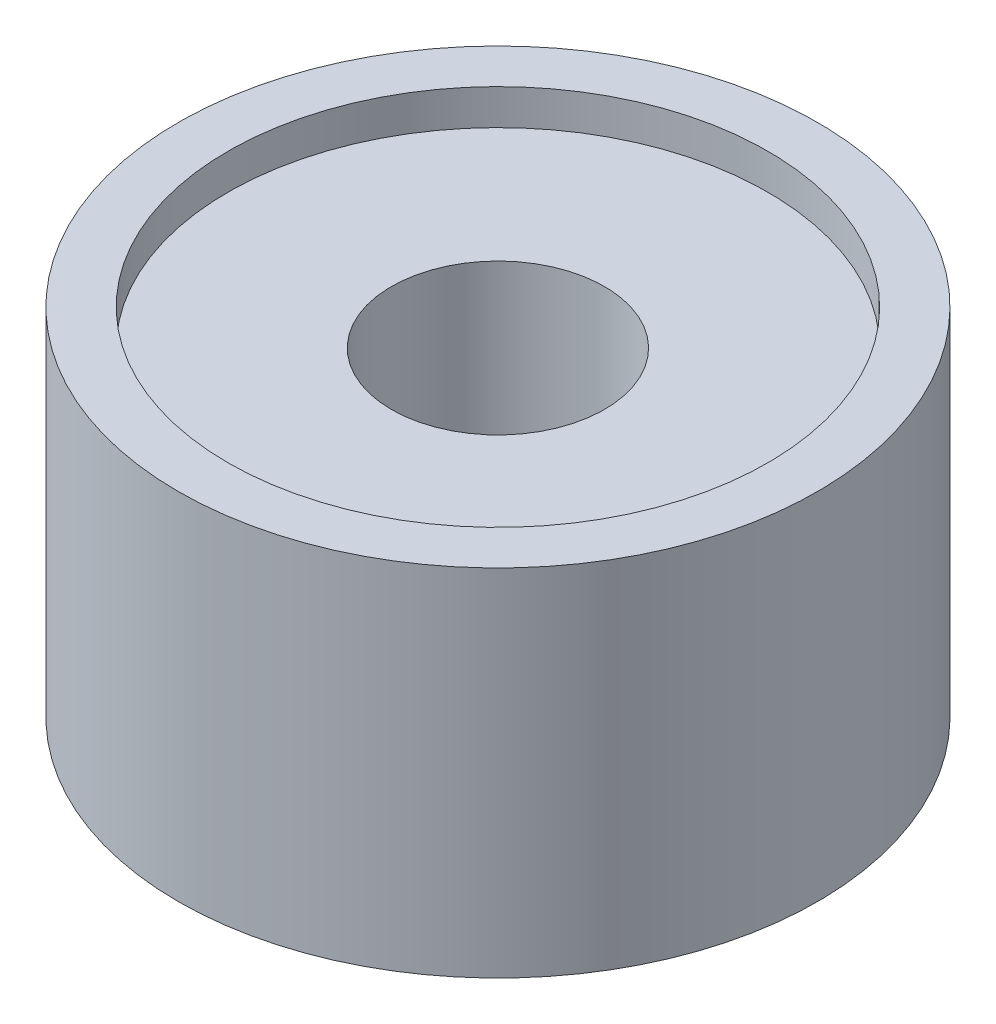
ISO-10303-21;
HEADER;
FILE_DESCRIPTION(('STEP AP214'),'2;1');
FILE_NAME('part.step','',(''),(''),'','','');
FILE_SCHEMA(('AUTOMOTIVE_DESIGN { 1 0 10303 214 1 1 1 1 }'));
ENDSEC;
DATA;
#1=APPLICATION_CONTEXT('core data for automotive mechanical design processes');
#2=APPLICATION_PROTOCOL_DEFINITION('international standard','automotive_design',2000,#1);
#3=PRODUCT_CONTEXT('',#1,'mechanical');
#4=PRODUCT('Part','Part','',(#3));
#5=PRODUCT_RELATED_PRODUCT_CATEGORY('part','',(#4));
#6=PRODUCT_DEFINITION_FORMATION('','',#4);
#7=PRODUCT_DEFINITION_CONTEXT('part definition',#1,'design');
#8=PRODUCT_DEFINITION('design','',#6,#7);
#9=PRODUCT_DEFINITION_SHAPE('','',#8);
#10=(LENGTH_UNIT() NAMED_UNIT(*) SI_UNIT(.MILLI.,.METRE.));
#11=(NAMED_UNIT(*) PLANE_ANGLE_UNIT() SI_UNIT($,.RADIAN.));
#12=(NAMED_UNIT(*) SI_UNIT($,.STERADIAN.) SOLID_ANGLE_UNIT());
#13=UNCERTAINTY_MEASURE_WITH_UNIT(LENGTH_MEASURE(1.E-05),#10,'distance_accuracy_value','');
#14=(GEOMETRIC_REPRESENTATION_CONTEXT(3) GLOBAL_UNCERTAINTY_ASSIGNED_CONTEXT((#13)) GLOBAL_UNIT_ASSIGNED_CONTEXT((#10,
#11,#12)) REPRESENTATION_CONTEXT('',''));
#15=CARTESIAN_POINT('',(0.,0.,0.));
#16=DIRECTION('',(0.,0.,1.));
#17=DIRECTION('',(1.,0.,0.));
#18=AXIS2_PLACEMENT_3D('',#15,#16,#17);
#19=CARTESIAN_POINT('',(0.,0.,0.));
#20=DIRECTION('',(0.,1.,0.));
#21=DIRECTION('',(0.,0.,1.));
#22=AXIS2_PLACEMENT_3D('',#19,#20,#21);
#23=CYLINDRICAL_SURFACE('',#22,1.5);
#24=CARTESIAN_POINT('',(0.,0.,0.));
#25=DIRECTION('',(0.,1.,0.));
#26=DIRECTION('',(0.,0.,1.));
#27=AXIS2_PLACEMENT_3D('',#24,#25,#26);
#28=CIRCLE('',#27,1.5);
#29=CARTESIAN_POINT('',(0.,0.,1.5));
#30=VERTEX_POINT('',#29);
#31=EDGE_CURVE('E44',#30,#30,#28,.T.);
#32=ORIENTED_EDGE('',*,*,#31,.F.);
#33=EDGE_LOOP('',(#32));
#34=FACE_BOUND('',#33,.T.);
#35=CARTESIAN_POINT('',(0.,4.5,0.));
#36=DIRECTION('',(0.,1.,0.));
#37=DIRECTION('',(0.,0.,1.));
#38=AXIS2_PLACEMENT_3D('',#35,#36,#37);
#39=CIRCLE('',#38,1.5);
#40=CARTESIAN_POINT('',(0.,4.5,1.5));
#41=VERTEX_POINT('',#40);
#42=EDGE_CURVE('E35',#41,#41,#39,.F.);
#43=ORIENTED_EDGE('',*,*,#42,.F.);
#44=EDGE_LOOP('',(#43));
#45=FACE_BOUND('',#44,.T.);
#46=ADVANCED_FACE('F31',(#34,#45),#23,.F.);
#47=CARTESIAN_POINT('',(0.,5.,0.));
#48=DIRECTION('',(0.,-1.,0.));
#49=DIRECTION('',(0.,0.,-1.));
#50=AXIS2_PLACEMENT_3D('',#47,#48,#49);
#51=CYLINDRICAL_SURFACE('',#50,4.5);
#52=CARTESIAN_POINT('',(0.,5.,0.));
#53=DIRECTION('',(0.,1.,0.));
#54=DIRECTION('',(0.,0.,1.));
#55=AXIS2_PLACEMENT_3D('',#52,#53,#54);
#56=CIRCLE('',#55,4.5);
#57=CARTESIAN_POINT('',(0.,5.,4.5));
#58=VERTEX_POINT('',#57);
#59=EDGE_CURVE('E10',#58,#58,#56,.T.);
#60=ORIENTED_EDGE('',*,*,#59,.F.);
#61=EDGE_LOOP('',(#60));
#62=FACE_BOUND('',#61,.T.);
#63=CARTESIAN_POINT('',(0.,0.,0.));
#64=DIRECTION('',(0.,1.,0.));
#65=DIRECTION('',(0.,0.,1.));
#66=AXIS2_PLACEMENT_3D('',#63,#64,#65);
#67=CIRCLE('',#66,4.5);
#68=CARTESIAN_POINT('',(0.,0.,4.5));
#69=VERTEX_POINT('',#68);
#70=EDGE_CURVE('E39',#69,#69,#67,.T.);
#71=ORIENTED_EDGE('',*,*,#70,.T.);
#72=EDGE_LOOP('',(#71));
#73=FACE_BOUND('',#72,.T.);
#74=ADVANCED_FACE('F33',(#62,#73),#51,.T.);
#75=CARTESIAN_POINT('',(0.,5.,0.));
#76=DIRECTION('',(0.,1.,0.));
#77=DIRECTION('',(0.,0.,1.));
#78=AXIS2_PLACEMENT_3D('',#75,#76,#77);
#79=PLANE('',#78);
#80=CARTESIAN_POINT('',(0.,5.,0.));
#81=DIRECTION('',(0.,1.,0.));
#82=DIRECTION('',(0.,0.,1.));
#83=AXIS2_PLACEMENT_3D('',#80,#81,#82);
#84=CIRCLE('',#83,3.8);
#85=CARTESIAN_POINT('',(0.,5.,3.8));
#86=VERTEX_POINT('',#85);
#87=EDGE_CURVE('E48',#86,#86,#84,.T.);
#88=ORIENTED_EDGE('',*,*,#87,.F.);
#89=EDGE_LOOP('',(#88));
#90=FACE_BOUND('',#89,.T.);
#91=ORIENTED_EDGE('',*,*,#59,.T.);
#92=EDGE_LOOP('',(#91));
#93=FACE_BOUND('',#92,.T.);
#94=ADVANCED_FACE('F66',(#90,#93),#79,.T.);
#95=CARTESIAN_POINT('',(0.,0.,0.));
#96=DIRECTION('',(0.,1.,0.));
#97=DIRECTION('',(0.,0.,1.));
#98=AXIS2_PLACEMENT_3D('',#95,#96,#97);
#99=PLANE('',#98);
#100=ORIENTED_EDGE('',*,*,#31,.T.);
#101=EDGE_LOOP('',(#100));
#102=FACE_BOUND('',#101,.T.);
#103=ORIENTED_EDGE('',*,*,#70,.F.);
#104=EDGE_LOOP('',(#103));
#105=FACE_BOUND('',#104,.T.);
#106=ADVANCED_FACE('F74',(#102,#105),#99,.F.);
#107=CARTESIAN_POINT('',(0.,4.5,0.));
#108=DIRECTION('',(0.,1.,0.));
#109=DIRECTION('',(0.,0.,1.));
#110=AXIS2_PLACEMENT_3D('',#107,#108,#109);
#111=PLANE('',#110);
#112=CARTESIAN_POINT('',(0.,4.5,0.));
#113=DIRECTION('',(0.,1.,0.));
#114=DIRECTION('',(0.,0.,1.));
#115=AXIS2_PLACEMENT_3D('',#112,#113,#114);
#116=CIRCLE('',#115,3.8);
#117=CARTESIAN_POINT('',(0.,4.5,3.8));
#118=VERTEX_POINT('',#117);
#119=EDGE_CURVE('E51',#118,#118,#116,.T.);
#120=ORIENTED_EDGE('',*,*,#119,.T.);
#121=EDGE_LOOP('',(#120));
#122=FACE_BOUND('',#121,.T.);
#123=ORIENTED_EDGE('',*,*,#42,.T.);
#124=EDGE_LOOP('',(#123));
#125=FACE_BOUND('',#124,.T.);
#126=ADVANCED_FACE('F58',(#122,#125),#111,.T.);
#127=CARTESIAN_POINT('',(0.,4.5,0.));
#128=DIRECTION('',(0.,1.,0.));
#129=DIRECTION('',(0.,0.,1.));
#130=AXIS2_PLACEMENT_3D('',#127,#128,#129);
#131=CYLINDRICAL_SURFACE('',#130,3.8);
#132=ORIENTED_EDGE('',*,*,#119,.F.);
#133=EDGE_LOOP('',(#132));
#134=FACE_BOUND('',#133,.T.);
#135=ORIENTED_EDGE('',*,*,#87,.T.);
#136=EDGE_LOOP('',(#135));
#137=FACE_BOUND('',#136,.T.);
#138=ADVANCED_FACE('F71',(#134,#137),#131,.F.);
#139=CLOSED_SHELL('',(#46,#74,#94,#106,#126,#138));
#140=MANIFOLD_SOLID_BREP('B2',#139);
#141=ADVANCED_BREP_SHAPE_REPRESENTATION('',(#18,#140),#14);
#142=SHAPE_DEFINITION_REPRESENTATION(#9,#141);
ENDSEC;
END-ISO-10303-21;
